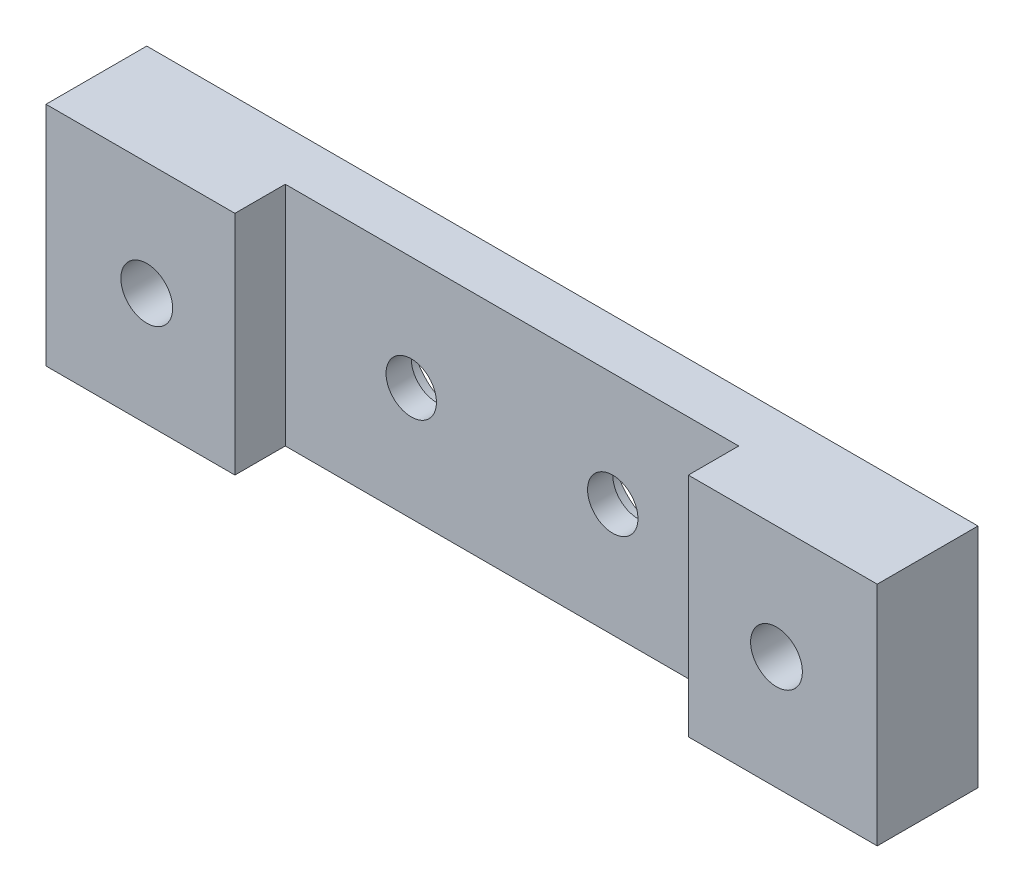
ISO-10303-21;
HEADER;
FILE_DESCRIPTION(('STEP AP214'),'2;1');
FILE_NAME('part.step','',(''),(''),'','','');
FILE_SCHEMA(('AUTOMOTIVE_DESIGN { 1 0 10303 214 1 1 1 1 }'));
ENDSEC;
DATA;
#1=APPLICATION_CONTEXT('core data for automotive mechanical design processes');
#2=APPLICATION_PROTOCOL_DEFINITION('international standard','automotive_design',2000,#1);
#3=PRODUCT_CONTEXT('',#1,'mechanical');
#4=PRODUCT('Part','Part','',(#3));
#5=PRODUCT_RELATED_PRODUCT_CATEGORY('part','',(#4));
#6=PRODUCT_DEFINITION_FORMATION('','',#4);
#7=PRODUCT_DEFINITION_CONTEXT('part definition',#1,'design');
#8=PRODUCT_DEFINITION('design','',#6,#7);
#9=PRODUCT_DEFINITION_SHAPE('','',#8);
#10=(LENGTH_UNIT() NAMED_UNIT(*) SI_UNIT(.MILLI.,.METRE.));
#11=(NAMED_UNIT(*) PLANE_ANGLE_UNIT() SI_UNIT($,.RADIAN.));
#12=(NAMED_UNIT(*) SI_UNIT($,.STERADIAN.) SOLID_ANGLE_UNIT());
#13=UNCERTAINTY_MEASURE_WITH_UNIT(LENGTH_MEASURE(1.E-05),#10,'distance_accuracy_value','');
#14=(GEOMETRIC_REPRESENTATION_CONTEXT(3) GLOBAL_UNCERTAINTY_ASSIGNED_CONTEXT((#13)) GLOBAL_UNIT_ASSIGNED_CONTEXT((#10,
#11,#12)) REPRESENTATION_CONTEXT('',''));
#15=CARTESIAN_POINT('',(0.,0.,0.));
#16=DIRECTION('',(0.,0.,1.));
#17=DIRECTION('',(1.,0.,0.));
#18=AXIS2_PLACEMENT_3D('',#15,#16,#17);
#19=CARTESIAN_POINT('',(-52.3875,28.575,12.7));
#20=DIRECTION('',(1.,0.,0.));
#21=DIRECTION('',(0.,0.,-1.));
#22=AXIS2_PLACEMENT_3D('',#19,#20,#21);
#23=PLANE('',#22);
#24=DIRECTION('',(0.,0.,1.));
#25=VECTOR('',#24,1.);
#26=CARTESIAN_POINT('',(-52.3875,0.,12.7));
#27=LINE('',#26,#25);
#28=CARTESIAN_POINT('',(-52.3875,0.,0.));
#29=VERTEX_POINT('',#28);
#30=CARTESIAN_POINT('',(-52.3875,0.,12.7));
#31=VERTEX_POINT('',#30);
#32=EDGE_CURVE('E143',#29,#31,#27,.T.);
#33=ORIENTED_EDGE('',*,*,#32,.T.);
#34=DIRECTION('',(0.,-1.,0.));
#35=VECTOR('',#34,1.);
#36=CARTESIAN_POINT('',(-52.3875,28.575,12.7));
#37=LINE('',#36,#35);
#38=CARTESIAN_POINT('',(-52.3875,28.575,12.7));
#39=VERTEX_POINT('',#38);
#40=EDGE_CURVE('E11',#39,#31,#37,.T.);
#41=ORIENTED_EDGE('',*,*,#40,.F.);
#42=DIRECTION('',(0.,0.,1.));
#43=VECTOR('',#42,1.);
#44=CARTESIAN_POINT('',(-52.3875,28.575,12.7));
#45=LINE('',#44,#43);
#46=CARTESIAN_POINT('',(-52.3875,28.575,0.));
#47=VERTEX_POINT('',#46);
#48=EDGE_CURVE('E165',#47,#39,#45,.T.);
#49=ORIENTED_EDGE('',*,*,#48,.F.);
#50=DIRECTION('',(0.,-1.,0.));
#51=VECTOR('',#50,1.);
#52=CARTESIAN_POINT('',(-52.3875,28.575,0.));
#53=LINE('',#52,#51);
#54=EDGE_CURVE('E139',#47,#29,#53,.T.);
#55=ORIENTED_EDGE('',*,*,#54,.T.);
#56=EDGE_LOOP('',(#33,#41,#49,#55));
#57=FACE_BOUND('',#56,.T.);
#58=ADVANCED_FACE('F38',(#57),#23,.F.);
#59=CARTESIAN_POINT('',(-28.575,28.575,12.7));
#60=DIRECTION('',(0.,0.,-1.));
#61=DIRECTION('',(-1.,0.,0.));
#62=AXIS2_PLACEMENT_3D('',#59,#60,#61);
#63=PLANE('',#62);
#64=CARTESIAN_POINT('',(-39.6875,14.2875,12.7));
#65=DIRECTION('',(0.,0.,1.));
#66=DIRECTION('',(1.,0.,0.));
#67=AXIS2_PLACEMENT_3D('',#64,#65,#66);
#68=CIRCLE('',#67,3.2639);
#69=CARTESIAN_POINT('',(-36.4236,14.2875,12.7));
#70=VERTEX_POINT('',#69);
#71=EDGE_CURVE('E447',#70,#70,#68,.T.);
#72=ORIENTED_EDGE('',*,*,#71,.F.);
#73=EDGE_LOOP('',(#72));
#74=FACE_BOUND('',#73,.T.);
#75=DIRECTION('',(1.,0.,0.));
#76=VECTOR('',#75,1.);
#77=CARTESIAN_POINT('',(-28.575,0.,12.7));
#78=LINE('',#77,#76);
#79=CARTESIAN_POINT('',(-28.575,0.,12.7));
#80=VERTEX_POINT('',#79);
#81=EDGE_CURVE('E147',#31,#80,#78,.T.);
#82=ORIENTED_EDGE('',*,*,#81,.T.);
#83=DIRECTION('',(0.,-1.,0.));
#84=VECTOR('',#83,1.);
#85=CARTESIAN_POINT('',(-28.575,28.575,12.7));
#86=LINE('',#85,#84);
#87=CARTESIAN_POINT('',(-28.575,28.575,12.7));
#88=VERTEX_POINT('',#87);
#89=EDGE_CURVE('E48',#88,#80,#86,.T.);
#90=ORIENTED_EDGE('',*,*,#89,.F.);
#91=DIRECTION('',(1.,0.,0.));
#92=VECTOR('',#91,1.);
#93=CARTESIAN_POINT('',(-28.575,28.575,12.7));
#94=LINE('',#93,#92);
#95=EDGE_CURVE('E100',#39,#88,#94,.T.);
#96=ORIENTED_EDGE('',*,*,#95,.F.);
#97=ORIENTED_EDGE('',*,*,#40,.T.);
#98=EDGE_LOOP('',(#82,#90,#96,#97));
#99=FACE_BOUND('',#98,.T.);
#100=ADVANCED_FACE('F256',(#74,#99),#63,.F.);
#101=CARTESIAN_POINT('',(-28.575,28.575,6.35000000000001));
#102=DIRECTION('',(-1.,0.,0.));
#103=DIRECTION('',(0.,0.,1.));
#104=AXIS2_PLACEMENT_3D('',#101,#102,#103);
#105=PLANE('',#104);
#106=DIRECTION('',(0.,0.,-1.));
#107=VECTOR('',#106,1.);
#108=CARTESIAN_POINT('',(-28.575,0.,6.35000000000001));
#109=LINE('',#108,#107);
#110=CARTESIAN_POINT('',(-28.575,0.,6.35000000000001));
#111=VERTEX_POINT('',#110);
#112=EDGE_CURVE('E150',#80,#111,#109,.T.);
#113=ORIENTED_EDGE('',*,*,#112,.T.);
#114=DIRECTION('',(0.,-1.,0.));
#115=VECTOR('',#114,1.);
#116=CARTESIAN_POINT('',(-28.575,28.575,6.35000000000001));
#117=LINE('',#116,#115);
#118=CARTESIAN_POINT('',(-28.575,28.575,6.35000000000001));
#119=VERTEX_POINT('',#118);
#120=EDGE_CURVE('E176',#119,#111,#117,.T.);
#121=ORIENTED_EDGE('',*,*,#120,.F.);
#122=DIRECTION('',(0.,0.,-1.));
#123=VECTOR('',#122,1.);
#124=CARTESIAN_POINT('',(-28.575,28.575,6.35000000000001));
#125=LINE('',#124,#123);
#126=EDGE_CURVE('E203',#88,#119,#125,.T.);
#127=ORIENTED_EDGE('',*,*,#126,.F.);
#128=ORIENTED_EDGE('',*,*,#89,.T.);
#129=EDGE_LOOP('',(#113,#121,#127,#128));
#130=FACE_BOUND('',#129,.T.);
#131=ADVANCED_FACE('F261',(#130),#105,.F.);
#132=CARTESIAN_POINT('',(28.575,28.575,6.35000000000001));
#133=DIRECTION('',(0.,0.,-1.));
#134=DIRECTION('',(-1.,0.,0.));
#135=AXIS2_PLACEMENT_3D('',#132,#133,#134);
#136=PLANE('',#135);
#137=CARTESIAN_POINT('',(12.7,14.2875,6.35000000000001));
#138=DIRECTION('',(0.,0.,-1.));
#139=DIRECTION('',(-1.,0.,0.));
#140=AXIS2_PLACEMENT_3D('',#137,#138,#139);
#141=CIRCLE('',#140,3.17500000000001);
#142=CARTESIAN_POINT('',(9.52499999999999,14.2875,6.35000000000001));
#143=VERTEX_POINT('',#142);
#144=EDGE_CURVE('E41',#143,#143,#141,.T.);
#145=ORIENTED_EDGE('',*,*,#144,.T.);
#146=EDGE_LOOP('',(#145));
#147=FACE_BOUND('',#146,.T.);
#148=CARTESIAN_POINT('',(-12.7,14.2875,6.35000000000001));
#149=DIRECTION('',(0.,0.,-1.));
#150=DIRECTION('',(-1.,0.,0.));
#151=AXIS2_PLACEMENT_3D('',#148,#149,#150);
#152=CIRCLE('',#151,3.17500000000001);
#153=CARTESIAN_POINT('',(-15.875,14.2875,6.35000000000001));
#154=VERTEX_POINT('',#153);
#155=EDGE_CURVE('E148',#154,#154,#152,.T.);
#156=ORIENTED_EDGE('',*,*,#155,.T.);
#157=EDGE_LOOP('',(#156));
#158=FACE_BOUND('',#157,.T.);
#159=DIRECTION('',(1.,0.,0.));
#160=VECTOR('',#159,1.);
#161=CARTESIAN_POINT('',(28.575,0.,6.35000000000001));
#162=LINE('',#161,#160);
#163=CARTESIAN_POINT('',(28.575,0.,6.35000000000001));
#164=VERTEX_POINT('',#163);
#165=EDGE_CURVE('E153',#111,#164,#162,.T.);
#166=ORIENTED_EDGE('',*,*,#165,.T.);
#167=DIRECTION('',(0.,-1.,0.));
#168=VECTOR('',#167,1.);
#169=CARTESIAN_POINT('',(28.575,28.575,6.35000000000001));
#170=LINE('',#169,#168);
#171=CARTESIAN_POINT('',(28.575,28.575,6.35000000000001));
#172=VERTEX_POINT('',#171);
#173=EDGE_CURVE('E172',#172,#164,#170,.T.);
#174=ORIENTED_EDGE('',*,*,#173,.F.);
#175=DIRECTION('',(1.,0.,0.));
#176=VECTOR('',#175,1.);
#177=CARTESIAN_POINT('',(28.575,28.575,6.35000000000001));
#178=LINE('',#177,#176);
#179=EDGE_CURVE('E206',#119,#172,#178,.T.);
#180=ORIENTED_EDGE('',*,*,#179,.F.);
#181=ORIENTED_EDGE('',*,*,#120,.T.);
#182=EDGE_LOOP('',(#166,#174,#180,#181));
#183=FACE_BOUND('',#182,.T.);
#184=ADVANCED_FACE('F237',(#147,#158,#183),#136,.F.);
#185=CARTESIAN_POINT('',(28.575,28.575,12.7));
#186=DIRECTION('',(1.,0.,0.));
#187=DIRECTION('',(0.,0.,-1.));
#188=AXIS2_PLACEMENT_3D('',#185,#186,#187);
#189=PLANE('',#188);
#190=DIRECTION('',(0.,0.,1.));
#191=VECTOR('',#190,1.);
#192=CARTESIAN_POINT('',(28.575,0.,12.7));
#193=LINE('',#192,#191);
#194=CARTESIAN_POINT('',(28.575,0.,12.7));
#195=VERTEX_POINT('',#194);
#196=EDGE_CURVE('E156',#164,#195,#193,.T.);
#197=ORIENTED_EDGE('',*,*,#196,.T.);
#198=DIRECTION('',(0.,-1.,0.));
#199=VECTOR('',#198,1.);
#200=CARTESIAN_POINT('',(28.575,28.575,12.7));
#201=LINE('',#200,#199);
#202=CARTESIAN_POINT('',(28.575,28.575,12.7));
#203=VERTEX_POINT('',#202);
#204=EDGE_CURVE('E130',#203,#195,#201,.T.);
#205=ORIENTED_EDGE('',*,*,#204,.F.);
#206=DIRECTION('',(0.,0.,1.));
#207=VECTOR('',#206,1.);
#208=CARTESIAN_POINT('',(28.575,28.575,12.7));
#209=LINE('',#208,#207);
#210=EDGE_CURVE('E119',#172,#203,#209,.T.);
#211=ORIENTED_EDGE('',*,*,#210,.F.);
#212=ORIENTED_EDGE('',*,*,#173,.T.);
#213=EDGE_LOOP('',(#197,#205,#211,#212));
#214=FACE_BOUND('',#213,.T.);
#215=ADVANCED_FACE('F278',(#214),#189,.F.);
#216=CARTESIAN_POINT('',(52.3875,28.575,12.7));
#217=DIRECTION('',(0.,0.,-1.));
#218=DIRECTION('',(-1.,0.,0.));
#219=AXIS2_PLACEMENT_3D('',#216,#217,#218);
#220=PLANE('',#219);
#221=CARTESIAN_POINT('',(39.6875,14.2875,12.7));
#222=DIRECTION('',(0.,0.,1.));
#223=DIRECTION('',(1.,0.,0.));
#224=AXIS2_PLACEMENT_3D('',#221,#222,#223);
#225=CIRCLE('',#224,3.2639);
#226=CARTESIAN_POINT('',(42.9514,14.2875,12.7));
#227=VERTEX_POINT('',#226);
#228=EDGE_CURVE('E211',#227,#227,#225,.T.);
#229=ORIENTED_EDGE('',*,*,#228,.F.);
#230=EDGE_LOOP('',(#229));
#231=FACE_BOUND('',#230,.T.);
#232=DIRECTION('',(1.,0.,0.));
#233=VECTOR('',#232,1.);
#234=CARTESIAN_POINT('',(52.3875,0.,12.7));
#235=LINE('',#234,#233);
#236=CARTESIAN_POINT('',(52.3875,0.,12.7));
#237=VERTEX_POINT('',#236);
#238=EDGE_CURVE('E128',#195,#237,#235,.T.);
#239=ORIENTED_EDGE('',*,*,#238,.T.);
#240=DIRECTION('',(0.,-1.,0.));
#241=VECTOR('',#240,1.);
#242=CARTESIAN_POINT('',(52.3875,28.575,12.7));
#243=LINE('',#242,#241);
#244=CARTESIAN_POINT('',(52.3875,28.575,12.7));
#245=VERTEX_POINT('',#244);
#246=EDGE_CURVE('E125',#245,#237,#243,.T.);
#247=ORIENTED_EDGE('',*,*,#246,.F.);
#248=DIRECTION('',(1.,0.,0.));
#249=VECTOR('',#248,1.);
#250=CARTESIAN_POINT('',(52.3875,28.575,12.7));
#251=LINE('',#250,#249);
#252=EDGE_CURVE('E113',#203,#245,#251,.T.);
#253=ORIENTED_EDGE('',*,*,#252,.F.);
#254=ORIENTED_EDGE('',*,*,#204,.T.);
#255=EDGE_LOOP('',(#239,#247,#253,#254));
#256=FACE_BOUND('',#255,.T.);
#257=ADVANCED_FACE('F126',(#231,#256),#220,.F.);
#258=CARTESIAN_POINT('',(52.3875,28.575,0.));
#259=DIRECTION('',(-1.,0.,0.));
#260=DIRECTION('',(0.,0.,1.));
#261=AXIS2_PLACEMENT_3D('',#258,#259,#260);
#262=PLANE('',#261);
#263=DIRECTION('',(0.,0.,-1.));
#264=VECTOR('',#263,1.);
#265=CARTESIAN_POINT('',(52.3875,0.,0.));
#266=LINE('',#265,#264);
#267=CARTESIAN_POINT('',(52.3875,0.,0.));
#268=VERTEX_POINT('',#267);
#269=EDGE_CURVE('E86',#237,#268,#266,.T.);
#270=ORIENTED_EDGE('',*,*,#269,.T.);
#271=DIRECTION('',(0.,-1.,0.));
#272=VECTOR('',#271,1.);
#273=CARTESIAN_POINT('',(52.3875,28.575,0.));
#274=LINE('',#273,#272);
#275=CARTESIAN_POINT('',(52.3875,28.575,0.));
#276=VERTEX_POINT('',#275);
#277=EDGE_CURVE('E131',#276,#268,#274,.T.);
#278=ORIENTED_EDGE('',*,*,#277,.F.);
#279=DIRECTION('',(0.,0.,-1.));
#280=VECTOR('',#279,1.);
#281=CARTESIAN_POINT('',(52.3875,28.575,0.));
#282=LINE('',#281,#280);
#283=EDGE_CURVE('E117',#245,#276,#282,.T.);
#284=ORIENTED_EDGE('',*,*,#283,.F.);
#285=ORIENTED_EDGE('',*,*,#246,.T.);
#286=EDGE_LOOP('',(#270,#278,#284,#285));
#287=FACE_BOUND('',#286,.T.);
#288=ADVANCED_FACE('F133',(#287),#262,.F.);
#289=CARTESIAN_POINT('',(-52.3875,28.575,0.));
#290=DIRECTION('',(0.,0.,1.));
#291=DIRECTION('',(1.,0.,0.));
#292=AXIS2_PLACEMENT_3D('',#289,#290,#291);
#293=PLANE('',#292);
#294=CARTESIAN_POINT('',(-39.6875,14.2875,0.));
#295=DIRECTION('',(0.,0.,1.));
#296=DIRECTION('',(1.,0.,0.));
#297=AXIS2_PLACEMENT_3D('',#294,#295,#296);
#298=CIRCLE('',#297,3.2639);
#299=CARTESIAN_POINT('',(-36.4236,14.2875,0.));
#300=VERTEX_POINT('',#299);
#301=EDGE_CURVE('E444',#300,#300,#298,.T.);
#302=ORIENTED_EDGE('',*,*,#301,.T.);
#303=EDGE_LOOP('',(#302));
#304=FACE_BOUND('',#303,.T.);
#305=CARTESIAN_POINT('',(39.6875,14.2875,0.));
#306=DIRECTION('',(0.,0.,1.));
#307=DIRECTION('',(1.,0.,0.));
#308=AXIS2_PLACEMENT_3D('',#305,#306,#307);
#309=CIRCLE('',#308,3.2639);
#310=CARTESIAN_POINT('',(42.9514,14.2875,0.));
#311=VERTEX_POINT('',#310);
#312=EDGE_CURVE('E212',#311,#311,#309,.T.);
#313=ORIENTED_EDGE('',*,*,#312,.T.);
#314=EDGE_LOOP('',(#313));
#315=FACE_BOUND('',#314,.T.);
#316=CARTESIAN_POINT('',(12.7,14.2875,0.));
#317=DIRECTION('',(0.,0.,-1.));
#318=DIRECTION('',(-1.,0.,0.));
#319=AXIS2_PLACEMENT_3D('',#316,#317,#318);
#320=CIRCLE('',#319,6.35);
#321=CARTESIAN_POINT('',(6.35,14.2875,0.));
#322=VERTEX_POINT('',#321);
#323=EDGE_CURVE('E214',#322,#322,#320,.T.);
#324=ORIENTED_EDGE('',*,*,#323,.F.);
#325=EDGE_LOOP('',(#324));
#326=FACE_BOUND('',#325,.T.);
#327=CARTESIAN_POINT('',(-12.7,14.2875,0.));
#328=DIRECTION('',(0.,0.,-1.));
#329=DIRECTION('',(-1.,0.,0.));
#330=AXIS2_PLACEMENT_3D('',#327,#328,#329);
#331=CIRCLE('',#330,6.35);
#332=CARTESIAN_POINT('',(-19.05,14.2875,0.));
#333=VERTEX_POINT('',#332);
#334=EDGE_CURVE('E195',#333,#333,#331,.T.);
#335=ORIENTED_EDGE('',*,*,#334,.F.);
#336=EDGE_LOOP('',(#335));
#337=FACE_BOUND('',#336,.T.);
#338=DIRECTION('',(-1.,0.,0.));
#339=VECTOR('',#338,1.);
#340=CARTESIAN_POINT('',(-52.3875,0.,0.));
#341=LINE('',#340,#339);
#342=EDGE_CURVE('E92',#268,#29,#341,.T.);
#343=ORIENTED_EDGE('',*,*,#342,.T.);
#344=ORIENTED_EDGE('',*,*,#54,.F.);
#345=DIRECTION('',(-1.,0.,0.));
#346=VECTOR('',#345,1.);
#347=CARTESIAN_POINT('',(-52.3875,28.575,0.));
#348=LINE('',#347,#346);
#349=EDGE_CURVE('E57',#276,#47,#348,.T.);
#350=ORIENTED_EDGE('',*,*,#349,.F.);
#351=ORIENTED_EDGE('',*,*,#277,.T.);
#352=EDGE_LOOP('',(#343,#344,#350,#351));
#353=FACE_BOUND('',#352,.T.);
#354=ADVANCED_FACE('F317',(#304,#315,#326,#337,#353),#293,.F.);
#355=CARTESIAN_POINT('',(0.,28.575,0.));
#356=DIRECTION('',(0.,-1.,0.));
#357=DIRECTION('',(0.,0.,-1.));
#358=AXIS2_PLACEMENT_3D('',#355,#356,#357);
#359=PLANE('',#358);
#360=ORIENTED_EDGE('',*,*,#48,.T.);
#361=ORIENTED_EDGE('',*,*,#95,.T.);
#362=ORIENTED_EDGE('',*,*,#126,.T.);
#363=ORIENTED_EDGE('',*,*,#179,.T.);
#364=ORIENTED_EDGE('',*,*,#210,.T.);
#365=ORIENTED_EDGE('',*,*,#252,.T.);
#366=ORIENTED_EDGE('',*,*,#283,.T.);
#367=ORIENTED_EDGE('',*,*,#349,.T.);
#368=EDGE_LOOP('',(#360,#361,#362,#363,#364,#365,#366,#367));
#369=FACE_BOUND('',#368,.T.);
#370=ADVANCED_FACE('F115',(#369),#359,.F.);
#371=CARTESIAN_POINT('',(0.,0.,0.));
#372=DIRECTION('',(0.,-1.,0.));
#373=DIRECTION('',(0.,0.,-1.));
#374=AXIS2_PLACEMENT_3D('',#371,#372,#373);
#375=PLANE('',#374);
#376=ORIENTED_EDGE('',*,*,#32,.F.);
#377=ORIENTED_EDGE('',*,*,#342,.F.);
#378=ORIENTED_EDGE('',*,*,#269,.F.);
#379=ORIENTED_EDGE('',*,*,#238,.F.);
#380=ORIENTED_EDGE('',*,*,#196,.F.);
#381=ORIENTED_EDGE('',*,*,#165,.F.);
#382=ORIENTED_EDGE('',*,*,#112,.F.);
#383=ORIENTED_EDGE('',*,*,#81,.F.);
#384=EDGE_LOOP('',(#376,#377,#378,#379,#380,#381,#382,#383));
#385=FACE_BOUND('',#384,.T.);
#386=ADVANCED_FACE('F267',(#385),#375,.T.);
#387=CARTESIAN_POINT('',(-12.7,14.2875,0.));
#388=DIRECTION('',(0.,0.,-1.));
#389=DIRECTION('',(-1.,0.,0.));
#390=AXIS2_PLACEMENT_3D('',#387,#388,#389);
#391=CYLINDRICAL_SURFACE('',#390,3.17500000000001);
#392=CARTESIAN_POINT('',(-12.7,14.2875,3.175));
#393=DIRECTION('',(0.,0.,-1.));
#394=DIRECTION('',(-1.,0.,0.));
#395=AXIS2_PLACEMENT_3D('',#392,#393,#394);
#396=CIRCLE('',#395,3.17500000000001);
#397=CARTESIAN_POINT('',(-15.875,14.2875,3.175));
#398=VERTEX_POINT('',#397);
#399=EDGE_CURVE('E183',#398,#398,#396,.T.);
#400=ORIENTED_EDGE('',*,*,#399,.T.);
#401=EDGE_LOOP('',(#400));
#402=FACE_BOUND('',#401,.T.);
#403=ORIENTED_EDGE('',*,*,#155,.F.);
#404=EDGE_LOOP('',(#403));
#405=FACE_BOUND('',#404,.T.);
#406=ADVANCED_FACE('F338',(#402,#405),#391,.F.);
#407=CARTESIAN_POINT('',(-9.52499999999999,14.2875,3.175));
#408=DIRECTION('',(0.,0.,1.));
#409=DIRECTION('',(1.,0.,0.));
#410=AXIS2_PLACEMENT_3D('',#407,#408,#409);
#411=PLANE('',#410);
#412=ORIENTED_EDGE('',*,*,#399,.F.);
#413=EDGE_LOOP('',(#412));
#414=FACE_BOUND('',#413,.T.);
#415=CARTESIAN_POINT('',(-12.7,14.2875,3.175));
#416=DIRECTION('',(0.,0.,-1.));
#417=DIRECTION('',(-1.,0.,0.));
#418=AXIS2_PLACEMENT_3D('',#415,#416,#417);
#419=CIRCLE('',#418,6.35);
#420=CARTESIAN_POINT('',(-19.05,14.2875,3.175));
#421=VERTEX_POINT('',#420);
#422=EDGE_CURVE('E189',#421,#421,#419,.T.);
#423=ORIENTED_EDGE('',*,*,#422,.T.);
#424=EDGE_LOOP('',(#423));
#425=FACE_BOUND('',#424,.T.);
#426=ADVANCED_FACE('F252',(#414,#425),#411,.F.);
#427=CARTESIAN_POINT('',(-12.7,14.2875,0.));
#428=DIRECTION('',(0.,0.,-1.));
#429=DIRECTION('',(-1.,0.,0.));
#430=AXIS2_PLACEMENT_3D('',#427,#428,#429);
#431=CYLINDRICAL_SURFACE('',#430,6.35);
#432=ORIENTED_EDGE('',*,*,#422,.F.);
#433=EDGE_LOOP('',(#432));
#434=FACE_BOUND('',#433,.T.);
#435=ORIENTED_EDGE('',*,*,#334,.T.);
#436=EDGE_LOOP('',(#435));
#437=FACE_BOUND('',#436,.T.);
#438=ADVANCED_FACE('F242',(#434,#437),#431,.F.);
#439=CARTESIAN_POINT('',(12.7,14.2875,0.));
#440=DIRECTION('',(0.,0.,-1.));
#441=DIRECTION('',(-1.,0.,0.));
#442=AXIS2_PLACEMENT_3D('',#439,#440,#441);
#443=CYLINDRICAL_SURFACE('',#442,3.17500000000001);
#444=CARTESIAN_POINT('',(12.7,14.2875,3.17499999999999));
#445=DIRECTION('',(0.,0.,-1.));
#446=DIRECTION('',(-1.,0.,0.));
#447=AXIS2_PLACEMENT_3D('',#444,#445,#446);
#448=CIRCLE('',#447,3.17500000000001);
#449=CARTESIAN_POINT('',(9.52499999999999,14.2875,3.17499999999999));
#450=VERTEX_POINT('',#449);
#451=EDGE_CURVE('E219',#450,#450,#448,.T.);
#452=ORIENTED_EDGE('',*,*,#451,.T.);
#453=EDGE_LOOP('',(#452));
#454=FACE_BOUND('',#453,.T.);
#455=ORIENTED_EDGE('',*,*,#144,.F.);
#456=EDGE_LOOP('',(#455));
#457=FACE_BOUND('',#456,.T.);
#458=ADVANCED_FACE('F239',(#454,#457),#443,.F.);
#459=CARTESIAN_POINT('',(15.875,14.2875,3.175));
#460=DIRECTION('',(0.,0.,1.));
#461=DIRECTION('',(1.,0.,0.));
#462=AXIS2_PLACEMENT_3D('',#459,#460,#461);
#463=PLANE('',#462);
#464=ORIENTED_EDGE('',*,*,#451,.F.);
#465=EDGE_LOOP('',(#464));
#466=FACE_BOUND('',#465,.T.);
#467=CARTESIAN_POINT('',(12.7,14.2875,3.175));
#468=DIRECTION('',(0.,0.,-1.));
#469=DIRECTION('',(-1.,0.,0.));
#470=AXIS2_PLACEMENT_3D('',#467,#468,#469);
#471=CIRCLE('',#470,6.35);
#472=CARTESIAN_POINT('',(6.35,14.2875,3.175));
#473=VERTEX_POINT('',#472);
#474=EDGE_CURVE('E217',#473,#473,#471,.T.);
#475=ORIENTED_EDGE('',*,*,#474,.T.);
#476=EDGE_LOOP('',(#475));
#477=FACE_BOUND('',#476,.T.);
#478=ADVANCED_FACE('F241',(#466,#477),#463,.F.);
#479=CARTESIAN_POINT('',(12.7,14.2875,0.));
#480=DIRECTION('',(0.,0.,-1.));
#481=DIRECTION('',(-1.,0.,0.));
#482=AXIS2_PLACEMENT_3D('',#479,#480,#481);
#483=CYLINDRICAL_SURFACE('',#482,6.35);
#484=ORIENTED_EDGE('',*,*,#474,.F.);
#485=EDGE_LOOP('',(#484));
#486=FACE_BOUND('',#485,.T.);
#487=ORIENTED_EDGE('',*,*,#323,.T.);
#488=EDGE_LOOP('',(#487));
#489=FACE_BOUND('',#488,.T.);
#490=ADVANCED_FACE('F249',(#486,#489),#483,.F.);
#491=CARTESIAN_POINT('',(39.6875,14.2875,12.7));
#492=DIRECTION('',(0.,0.,1.));
#493=DIRECTION('',(1.,0.,0.));
#494=AXIS2_PLACEMENT_3D('',#491,#492,#493);
#495=CYLINDRICAL_SURFACE('',#494,3.2639);
#496=ORIENTED_EDGE('',*,*,#312,.F.);
#497=EDGE_LOOP('',(#496));
#498=FACE_BOUND('',#497,.T.);
#499=ORIENTED_EDGE('',*,*,#228,.T.);
#500=EDGE_LOOP('',(#499));
#501=FACE_BOUND('',#500,.T.);
#502=ADVANCED_FACE('F373',(#498,#501),#495,.F.);
#503=CARTESIAN_POINT('',(-39.6875,14.2875,12.7));
#504=DIRECTION('',(0.,0.,1.));
#505=DIRECTION('',(1.,0.,0.));
#506=AXIS2_PLACEMENT_3D('',#503,#504,#505);
#507=CYLINDRICAL_SURFACE('',#506,3.2639);
#508=ORIENTED_EDGE('',*,*,#301,.F.);
#509=EDGE_LOOP('',(#508));
#510=FACE_BOUND('',#509,.T.);
#511=ORIENTED_EDGE('',*,*,#71,.T.);
#512=EDGE_LOOP('',(#511));
#513=FACE_BOUND('',#512,.T.);
#514=ADVANCED_FACE('F382',(#510,#513),#507,.F.);
#515=CLOSED_SHELL('',(#58,#100,#131,#184,#215,#257,#288,#354,#370,#386,#406,#426,#438,#458,#478,
#490,#502,#514));
#516=MANIFOLD_SOLID_BREP('B2',#515);
#517=ADVANCED_BREP_SHAPE_REPRESENTATION('',(#18,#516),#14);
#518=SHAPE_DEFINITION_REPRESENTATION(#9,#517);
ENDSEC;
END-ISO-10303-21;
